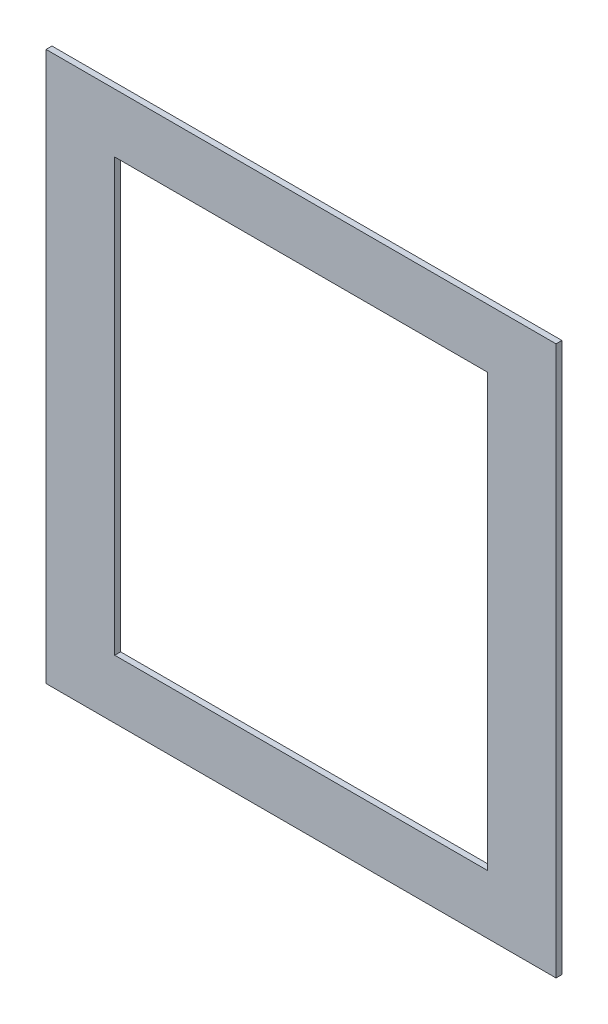
ISO-10303-21;
HEADER;
FILE_DESCRIPTION(('STEP AP214'),'2;1');
FILE_NAME('part.step','',(''),(''),'','','');
FILE_SCHEMA(('AUTOMOTIVE_DESIGN { 1 0 10303 214 1 1 1 1 }'));
ENDSEC;
DATA;
#1=APPLICATION_CONTEXT('core data for automotive mechanical design processes');
#2=APPLICATION_PROTOCOL_DEFINITION('international standard','automotive_design',2000,#1);
#3=PRODUCT_CONTEXT('',#1,'mechanical');
#4=PRODUCT('Part','Part','',(#3));
#5=PRODUCT_RELATED_PRODUCT_CATEGORY('part','',(#4));
#6=PRODUCT_DEFINITION_FORMATION('','',#4);
#7=PRODUCT_DEFINITION_CONTEXT('part definition',#1,'design');
#8=PRODUCT_DEFINITION('design','',#6,#7);
#9=PRODUCT_DEFINITION_SHAPE('','',#8);
#10=(LENGTH_UNIT() NAMED_UNIT(*) SI_UNIT(.MILLI.,.METRE.));
#11=(NAMED_UNIT(*) PLANE_ANGLE_UNIT() SI_UNIT($,.RADIAN.));
#12=(NAMED_UNIT(*) SI_UNIT($,.STERADIAN.) SOLID_ANGLE_UNIT());
#13=UNCERTAINTY_MEASURE_WITH_UNIT(LENGTH_MEASURE(1.E-05),#10,'distance_accuracy_value','');
#14=(GEOMETRIC_REPRESENTATION_CONTEXT(3) GLOBAL_UNCERTAINTY_ASSIGNED_CONTEXT((#13)) GLOBAL_UNIT_ASSIGNED_CONTEXT((#10,
#11,#12)) REPRESENTATION_CONTEXT('',''));
#15=CARTESIAN_POINT('',(0.,0.,0.));
#16=DIRECTION('',(0.,0.,1.));
#17=DIRECTION('',(1.,0.,0.));
#18=AXIS2_PLACEMENT_3D('',#15,#16,#17);
#19=CARTESIAN_POINT('',(0.,0.,6.));
#20=DIRECTION('',(0.,0.,1.));
#21=DIRECTION('',(1.,0.,0.));
#22=AXIS2_PLACEMENT_3D('',#19,#20,#21);
#23=PLANE('',#22);
#24=DIRECTION('',(0.,-1.,0.));
#25=VECTOR('',#24,1.);
#26=CARTESIAN_POINT('',(-57.6720828317545,540.464227839491,6.));
#27=LINE('',#26,#25);
#28=CARTESIAN_POINT('',(-57.6720828317545,540.464227839491,6.));
#29=VERTEX_POINT('',#28);
#30=CARTESIAN_POINT('',(-57.6720828317544,-19.5357721605093,6.));
#31=VERTEX_POINT('',#30);
#32=EDGE_CURVE('E135',#29,#31,#27,.T.);
#33=ORIENTED_EDGE('',*,*,#32,.T.);
#34=DIRECTION('',(1.,0.,0.));
#35=VECTOR('',#34,1.);
#36=CARTESIAN_POINT('',(-57.6720828317544,-19.5357721605093,6.));
#37=LINE('',#36,#35);
#38=CARTESIAN_POINT('',(462.327917168246,-19.5357721605093,6.));
#39=VERTEX_POINT('',#38);
#40=EDGE_CURVE('E138',#31,#39,#37,.T.);
#41=ORIENTED_EDGE('',*,*,#40,.T.);
#42=DIRECTION('',(0.,1.,0.));
#43=VECTOR('',#42,1.);
#44=CARTESIAN_POINT('',(462.327917168246,540.464227839491,6.));
#45=LINE('',#44,#43);
#46=CARTESIAN_POINT('',(462.327917168246,540.464227839491,6.));
#47=VERTEX_POINT('',#46);
#48=EDGE_CURVE('E141',#39,#47,#45,.T.);
#49=ORIENTED_EDGE('',*,*,#48,.T.);
#50=DIRECTION('',(-1.,0.,0.));
#51=VECTOR('',#50,1.);
#52=CARTESIAN_POINT('',(-57.6720828317545,540.464227839491,6.));
#53=LINE('',#52,#51);
#54=EDGE_CURVE('E143',#47,#29,#53,.T.);
#55=ORIENTED_EDGE('',*,*,#54,.T.);
#56=EDGE_LOOP('',(#33,#41,#49,#55));
#57=FACE_BOUND('',#56,.T.);
#58=DIRECTION('',(0.,-1.,0.));
#59=VECTOR('',#58,1.);
#60=CARTESIAN_POINT('',(12.3279171682455,480.464227839491,6.));
#61=LINE('',#60,#59);
#62=CARTESIAN_POINT('',(12.3279171682455,480.464227839491,6.));
#63=VERTEX_POINT('',#62);
#64=CARTESIAN_POINT('',(12.3279171682456,40.4642278394907,6.));
#65=VERTEX_POINT('',#64);
#66=EDGE_CURVE('E107',#63,#65,#61,.T.);
#67=ORIENTED_EDGE('',*,*,#66,.F.);
#68=DIRECTION('',(-1.,0.,0.));
#69=VECTOR('',#68,1.);
#70=CARTESIAN_POINT('',(12.3279171682455,480.464227839491,6.));
#71=LINE('',#70,#69);
#72=CARTESIAN_POINT('',(392.327917168246,480.464227839491,6.));
#73=VERTEX_POINT('',#72);
#74=EDGE_CURVE('E99',#73,#63,#71,.T.);
#75=ORIENTED_EDGE('',*,*,#74,.F.);
#76=DIRECTION('',(0.,1.,0.));
#77=VECTOR('',#76,1.);
#78=CARTESIAN_POINT('',(392.327917168246,480.464227839491,6.));
#79=LINE('',#78,#77);
#80=CARTESIAN_POINT('',(392.327917168246,40.4642278394907,6.));
#81=VERTEX_POINT('',#80);
#82=EDGE_CURVE('E121',#81,#73,#79,.T.);
#83=ORIENTED_EDGE('',*,*,#82,.F.);
#84=DIRECTION('',(1.,0.,0.));
#85=VECTOR('',#84,1.);
#86=CARTESIAN_POINT('',(12.3279171682456,40.4642278394907,6.));
#87=LINE('',#86,#85);
#88=EDGE_CURVE('E119',#65,#81,#87,.T.);
#89=ORIENTED_EDGE('',*,*,#88,.F.);
#90=EDGE_LOOP('',(#67,#75,#83,#89));
#91=FACE_BOUND('',#90,.T.);
#92=ADVANCED_FACE('F34',(#57,#91),#23,.T.);
#93=CARTESIAN_POINT('',(0.,0.,0.));
#94=DIRECTION('',(0.,0.,1.));
#95=DIRECTION('',(1.,0.,0.));
#96=AXIS2_PLACEMENT_3D('',#93,#94,#95);
#97=PLANE('',#96);
#98=DIRECTION('',(0.,-1.,0.));
#99=VECTOR('',#98,1.);
#100=CARTESIAN_POINT('',(-57.6720828317545,540.464227839491,0.));
#101=LINE('',#100,#99);
#102=CARTESIAN_POINT('',(-57.6720828317545,540.464227839491,0.));
#103=VERTEX_POINT('',#102);
#104=CARTESIAN_POINT('',(-57.6720828317544,-19.5357721605093,0.));
#105=VERTEX_POINT('',#104);
#106=EDGE_CURVE('E115',#103,#105,#101,.T.);
#107=ORIENTED_EDGE('',*,*,#106,.F.);
#108=DIRECTION('',(-1.,0.,0.));
#109=VECTOR('',#108,1.);
#110=CARTESIAN_POINT('',(-57.6720828317545,540.464227839491,0.));
#111=LINE('',#110,#109);
#112=CARTESIAN_POINT('',(462.327917168246,540.464227839491,0.));
#113=VERTEX_POINT('',#112);
#114=EDGE_CURVE('E139',#113,#103,#111,.T.);
#115=ORIENTED_EDGE('',*,*,#114,.F.);
#116=DIRECTION('',(0.,1.,0.));
#117=VECTOR('',#116,1.);
#118=CARTESIAN_POINT('',(462.327917168246,540.464227839491,0.));
#119=LINE('',#118,#117);
#120=CARTESIAN_POINT('',(462.327917168246,-19.5357721605093,0.));
#121=VERTEX_POINT('',#120);
#122=EDGE_CURVE('E150',#121,#113,#119,.T.);
#123=ORIENTED_EDGE('',*,*,#122,.F.);
#124=DIRECTION('',(1.,0.,0.));
#125=VECTOR('',#124,1.);
#126=CARTESIAN_POINT('',(-57.6720828317544,-19.5357721605093,0.));
#127=LINE('',#126,#125);
#128=EDGE_CURVE('E148',#105,#121,#127,.T.);
#129=ORIENTED_EDGE('',*,*,#128,.F.);
#130=EDGE_LOOP('',(#107,#115,#123,#129));
#131=FACE_BOUND('',#130,.T.);
#132=DIRECTION('',(-1.,0.,0.));
#133=VECTOR('',#132,1.);
#134=CARTESIAN_POINT('',(12.3279171682455,480.464227839491,0.));
#135=LINE('',#134,#133);
#136=CARTESIAN_POINT('',(392.327917168246,480.464227839491,0.));
#137=VERTEX_POINT('',#136);
#138=CARTESIAN_POINT('',(12.3279171682455,480.464227839491,0.));
#139=VERTEX_POINT('',#138);
#140=EDGE_CURVE('E57',#137,#139,#135,.T.);
#141=ORIENTED_EDGE('',*,*,#140,.T.);
#142=DIRECTION('',(0.,-1.,0.));
#143=VECTOR('',#142,1.);
#144=CARTESIAN_POINT('',(12.3279171682455,480.464227839491,0.));
#145=LINE('',#144,#143);
#146=CARTESIAN_POINT('',(12.3279171682456,40.4642278394907,0.));
#147=VERTEX_POINT('',#146);
#148=EDGE_CURVE('E114',#139,#147,#145,.T.);
#149=ORIENTED_EDGE('',*,*,#148,.T.);
#150=DIRECTION('',(1.,0.,0.));
#151=VECTOR('',#150,1.);
#152=CARTESIAN_POINT('',(12.3279171682456,40.4642278394907,0.));
#153=LINE('',#152,#151);
#154=CARTESIAN_POINT('',(392.327917168246,40.4642278394907,0.));
#155=VERTEX_POINT('',#154);
#156=EDGE_CURVE('E127',#147,#155,#153,.T.);
#157=ORIENTED_EDGE('',*,*,#156,.T.);
#158=DIRECTION('',(0.,1.,0.));
#159=VECTOR('',#158,1.);
#160=CARTESIAN_POINT('',(392.327917168246,480.464227839491,0.));
#161=LINE('',#160,#159);
#162=EDGE_CURVE('E108',#155,#137,#161,.T.);
#163=ORIENTED_EDGE('',*,*,#162,.T.);
#164=EDGE_LOOP('',(#141,#149,#157,#163));
#165=FACE_BOUND('',#164,.T.);
#166=ADVANCED_FACE('F168',(#131,#165),#97,.F.);
#167=CARTESIAN_POINT('',(-57.6720828317545,540.464227839491,6.));
#168=DIRECTION('',(1.,0.,0.));
#169=DIRECTION('',(0.,1.,0.));
#170=AXIS2_PLACEMENT_3D('',#167,#168,#169);
#171=PLANE('',#170);
#172=ORIENTED_EDGE('',*,*,#106,.T.);
#173=DIRECTION('',(0.,0.,-1.));
#174=VECTOR('',#173,1.);
#175=CARTESIAN_POINT('',(-57.6720828317544,-19.5357721605093,6.));
#176=LINE('',#175,#174);
#177=EDGE_CURVE('E11',#31,#105,#176,.T.);
#178=ORIENTED_EDGE('',*,*,#177,.F.);
#179=ORIENTED_EDGE('',*,*,#32,.F.);
#180=DIRECTION('',(0.,0.,-1.));
#181=VECTOR('',#180,1.);
#182=CARTESIAN_POINT('',(-57.6720828317545,540.464227839491,6.));
#183=LINE('',#182,#181);
#184=EDGE_CURVE('E145',#29,#103,#183,.T.);
#185=ORIENTED_EDGE('',*,*,#184,.T.);
#186=EDGE_LOOP('',(#172,#178,#179,#185));
#187=FACE_BOUND('',#186,.T.);
#188=ADVANCED_FACE('F36',(#187),#171,.F.);
#189=CARTESIAN_POINT('',(-57.6720828317544,-19.5357721605093,6.));
#190=DIRECTION('',(0.,1.,0.));
#191=DIRECTION('',(-1.,0.,0.));
#192=AXIS2_PLACEMENT_3D('',#189,#190,#191);
#193=PLANE('',#192);
#194=ORIENTED_EDGE('',*,*,#128,.T.);
#195=DIRECTION('',(0.,0.,-1.));
#196=VECTOR('',#195,1.);
#197=CARTESIAN_POINT('',(462.327917168246,-19.5357721605093,6.));
#198=LINE('',#197,#196);
#199=EDGE_CURVE('E42',#39,#121,#198,.T.);
#200=ORIENTED_EDGE('',*,*,#199,.F.);
#201=ORIENTED_EDGE('',*,*,#40,.F.);
#202=ORIENTED_EDGE('',*,*,#177,.T.);
#203=EDGE_LOOP('',(#194,#200,#201,#202));
#204=FACE_BOUND('',#203,.T.);
#205=ADVANCED_FACE('F178',(#204),#193,.F.);
#206=CARTESIAN_POINT('',(462.327917168246,540.464227839491,6.));
#207=DIRECTION('',(-1.,0.,0.));
#208=DIRECTION('',(0.,0.,1.));
#209=AXIS2_PLACEMENT_3D('',#206,#207,#208);
#210=PLANE('',#209);
#211=ORIENTED_EDGE('',*,*,#122,.T.);
#212=DIRECTION('',(0.,0.,-1.));
#213=VECTOR('',#212,1.);
#214=CARTESIAN_POINT('',(462.327917168246,540.464227839491,6.));
#215=LINE('',#214,#213);
#216=EDGE_CURVE('E155',#47,#113,#215,.T.);
#217=ORIENTED_EDGE('',*,*,#216,.F.);
#218=ORIENTED_EDGE('',*,*,#48,.F.);
#219=ORIENTED_EDGE('',*,*,#199,.T.);
#220=EDGE_LOOP('',(#211,#217,#218,#219));
#221=FACE_BOUND('',#220,.T.);
#222=ADVANCED_FACE('F162',(#221),#210,.F.);
#223=CARTESIAN_POINT('',(-57.6720828317545,540.464227839491,6.));
#224=DIRECTION('',(0.,-1.,0.));
#225=DIRECTION('',(0.,0.,-1.));
#226=AXIS2_PLACEMENT_3D('',#223,#224,#225);
#227=PLANE('',#226);
#228=ORIENTED_EDGE('',*,*,#114,.T.);
#229=ORIENTED_EDGE('',*,*,#184,.F.);
#230=ORIENTED_EDGE('',*,*,#54,.F.);
#231=ORIENTED_EDGE('',*,*,#216,.T.);
#232=EDGE_LOOP('',(#228,#229,#230,#231));
#233=FACE_BOUND('',#232,.T.);
#234=ADVANCED_FACE('F172',(#233),#227,.F.);
#235=CARTESIAN_POINT('',(12.3279171682455,480.464227839491,6.));
#236=DIRECTION('',(0.,-1.,0.));
#237=DIRECTION('',(0.,0.,-1.));
#238=AXIS2_PLACEMENT_3D('',#235,#236,#237);
#239=PLANE('',#238);
#240=ORIENTED_EDGE('',*,*,#140,.F.);
#241=DIRECTION('',(0.,0.,-1.));
#242=VECTOR('',#241,1.);
#243=CARTESIAN_POINT('',(392.327917168246,480.464227839491,6.));
#244=LINE('',#243,#242);
#245=EDGE_CURVE('E103',#73,#137,#244,.T.);
#246=ORIENTED_EDGE('',*,*,#245,.F.);
#247=ORIENTED_EDGE('',*,*,#74,.T.);
#248=DIRECTION('',(0.,0.,-1.));
#249=VECTOR('',#248,1.);
#250=CARTESIAN_POINT('',(12.3279171682455,480.464227839491,6.));
#251=LINE('',#250,#249);
#252=EDGE_CURVE('E102',#63,#139,#251,.T.);
#253=ORIENTED_EDGE('',*,*,#252,.T.);
#254=EDGE_LOOP('',(#240,#246,#247,#253));
#255=FACE_BOUND('',#254,.T.);
#256=ADVANCED_FACE('F101',(#255),#239,.T.);
#257=CARTESIAN_POINT('',(12.3279171682455,480.464227839491,6.));
#258=DIRECTION('',(1.,0.,0.));
#259=DIRECTION('',(0.,1.,0.));
#260=AXIS2_PLACEMENT_3D('',#257,#258,#259);
#261=PLANE('',#260);
#262=ORIENTED_EDGE('',*,*,#148,.F.);
#263=ORIENTED_EDGE('',*,*,#252,.F.);
#264=ORIENTED_EDGE('',*,*,#66,.T.);
#265=DIRECTION('',(0.,0.,-1.));
#266=VECTOR('',#265,1.);
#267=CARTESIAN_POINT('',(12.3279171682456,40.4642278394907,6.));
#268=LINE('',#267,#266);
#269=EDGE_CURVE('E116',#65,#147,#268,.T.);
#270=ORIENTED_EDGE('',*,*,#269,.T.);
#271=EDGE_LOOP('',(#262,#263,#264,#270));
#272=FACE_BOUND('',#271,.T.);
#273=ADVANCED_FACE('F111',(#272),#261,.T.);
#274=CARTESIAN_POINT('',(12.3279171682456,40.4642278394907,6.));
#275=DIRECTION('',(0.,1.,0.));
#276=DIRECTION('',(0.,0.,1.));
#277=AXIS2_PLACEMENT_3D('',#274,#275,#276);
#278=PLANE('',#277);
#279=ORIENTED_EDGE('',*,*,#156,.F.);
#280=ORIENTED_EDGE('',*,*,#269,.F.);
#281=ORIENTED_EDGE('',*,*,#88,.T.);
#282=DIRECTION('',(0.,0.,-1.));
#283=VECTOR('',#282,1.);
#284=CARTESIAN_POINT('',(392.327917168246,40.4642278394907,6.));
#285=LINE('',#284,#283);
#286=EDGE_CURVE('E49',#81,#155,#285,.T.);
#287=ORIENTED_EDGE('',*,*,#286,.T.);
#288=EDGE_LOOP('',(#279,#280,#281,#287));
#289=FACE_BOUND('',#288,.T.);
#290=ADVANCED_FACE('F201',(#289),#278,.T.);
#291=CARTESIAN_POINT('',(392.327917168246,480.464227839491,6.));
#292=DIRECTION('',(-1.,0.,0.));
#293=DIRECTION('',(0.,-1.,0.));
#294=AXIS2_PLACEMENT_3D('',#291,#292,#293);
#295=PLANE('',#294);
#296=ORIENTED_EDGE('',*,*,#162,.F.);
#297=ORIENTED_EDGE('',*,*,#286,.F.);
#298=ORIENTED_EDGE('',*,*,#82,.T.);
#299=ORIENTED_EDGE('',*,*,#245,.T.);
#300=EDGE_LOOP('',(#296,#297,#298,#299));
#301=FACE_BOUND('',#300,.T.);
#302=ADVANCED_FACE('F205',(#301),#295,.T.);
#303=CLOSED_SHELL('',(#92,#166,#188,#205,#222,#234,#256,#273,#290,#302));
#304=MANIFOLD_SOLID_BREP('B2',#303);
#305=ADVANCED_BREP_SHAPE_REPRESENTATION('',(#18,#304),#14);
#306=SHAPE_DEFINITION_REPRESENTATION(#9,#305);
ENDSEC;
END-ISO-10303-21;
